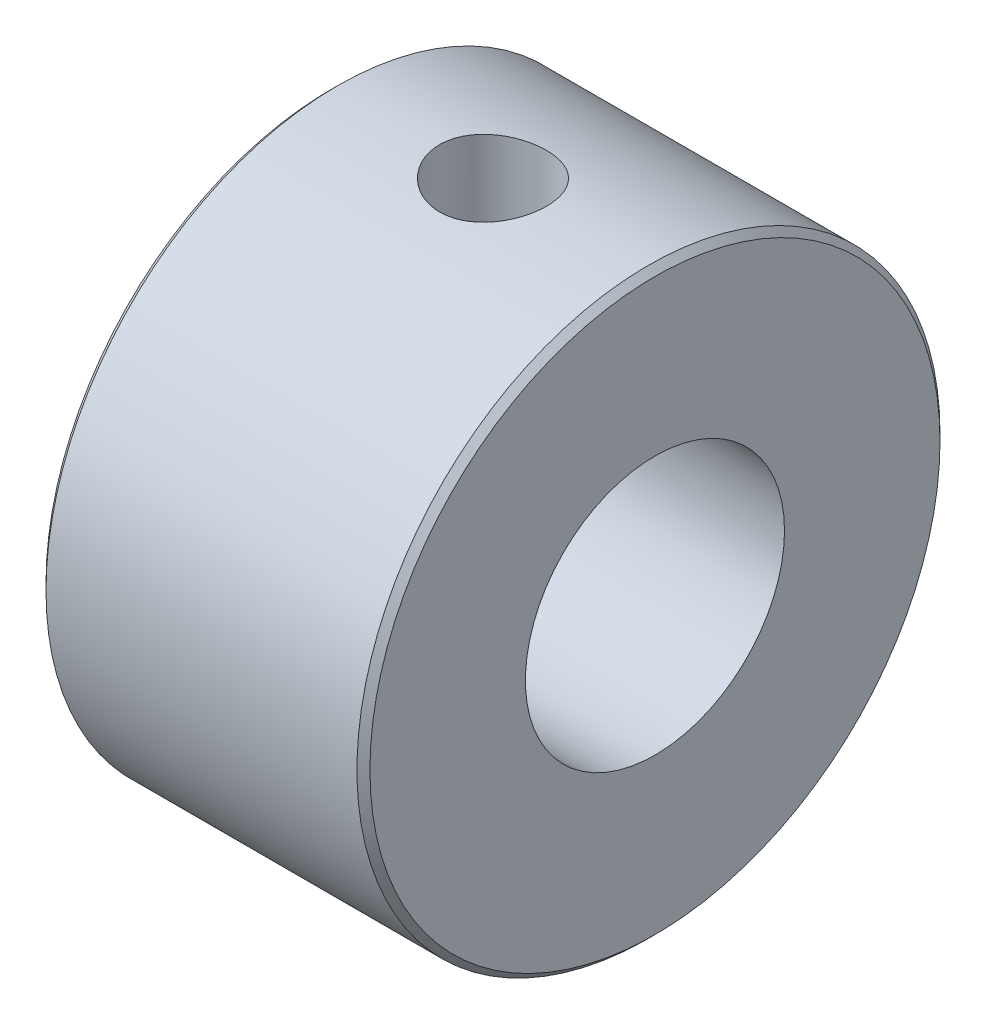
ISO-10303-21;
HEADER;
FILE_DESCRIPTION(('STEP AP214'),'2;1');
FILE_NAME('part.step','',(''),(''),'','','');
FILE_SCHEMA(('AUTOMOTIVE_DESIGN { 1 0 10303 214 1 1 1 1 }'));
ENDSEC;
DATA;
#1=APPLICATION_CONTEXT('core data for automotive mechanical design processes');
#2=APPLICATION_PROTOCOL_DEFINITION('international standard','automotive_design',2000,#1);
#3=PRODUCT_CONTEXT('',#1,'mechanical');
#4=PRODUCT('Part','Part','',(#3));
#5=PRODUCT_RELATED_PRODUCT_CATEGORY('part','',(#4));
#6=PRODUCT_DEFINITION_FORMATION('','',#4);
#7=PRODUCT_DEFINITION_CONTEXT('part definition',#1,'design');
#8=PRODUCT_DEFINITION('design','',#6,#7);
#9=PRODUCT_DEFINITION_SHAPE('','',#8);
#10=(LENGTH_UNIT() NAMED_UNIT(*) SI_UNIT(.MILLI.,.METRE.));
#11=(NAMED_UNIT(*) PLANE_ANGLE_UNIT() SI_UNIT($,.RADIAN.));
#12=(NAMED_UNIT(*) SI_UNIT($,.STERADIAN.) SOLID_ANGLE_UNIT());
#13=UNCERTAINTY_MEASURE_WITH_UNIT(LENGTH_MEASURE(1.E-05),#10,'distance_accuracy_value','');
#14=(GEOMETRIC_REPRESENTATION_CONTEXT(3) GLOBAL_UNCERTAINTY_ASSIGNED_CONTEXT((#13)) GLOBAL_UNIT_ASSIGNED_CONTEXT((#10,
#11,#12)) REPRESENTATION_CONTEXT('',''));
#15=CARTESIAN_POINT('',(0.,0.,0.));
#16=DIRECTION('',(0.,0.,1.));
#17=DIRECTION('',(1.,0.,0.));
#18=AXIS2_PLACEMENT_3D('',#15,#16,#17);
#19=CARTESIAN_POINT('',(-5.,4.,0.));
#20=DIRECTION('',(-1.,0.,0.));
#21=DIRECTION('',(0.,0.,1.));
#22=AXIS2_PLACEMENT_3D('',#19,#20,#21);
#23=PLANE('',#22);
#24=CARTESIAN_POINT('',(-5.,0.,0.));
#25=DIRECTION('',(-1.,0.,0.));
#26=DIRECTION('',(0.,0.,1.));
#27=AXIS2_PLACEMENT_3D('',#24,#25,#26);
#28=CIRCLE('',#27,8.8);
#29=CARTESIAN_POINT('',(-5.,0.,8.8));
#30=VERTEX_POINT('',#29);
#31=EDGE_CURVE('E42',#30,#30,#28,.T.);
#32=ORIENTED_EDGE('',*,*,#31,.T.);
#33=EDGE_LOOP('',(#32));
#34=FACE_BOUND('',#33,.T.);
#35=CARTESIAN_POINT('',(-5.,0.,0.));
#36=DIRECTION('',(1.,0.,0.));
#37=DIRECTION('',(0.,0.,-1.));
#38=AXIS2_PLACEMENT_3D('',#35,#36,#37);
#39=CIRCLE('',#38,4.);
#40=CARTESIAN_POINT('',(-5.,0.,-4.));
#41=VERTEX_POINT('',#40);
#42=EDGE_CURVE('E58',#41,#41,#39,.T.);
#43=ORIENTED_EDGE('',*,*,#42,.T.);
#44=EDGE_LOOP('',(#43));
#45=FACE_BOUND('',#44,.T.);
#46=ADVANCED_FACE('F35',(#34,#45),#23,.T.);
#47=CARTESIAN_POINT('',(0.,0.,0.));
#48=DIRECTION('',(1.,0.,0.));
#49=DIRECTION('',(0.,0.,-1.));
#50=AXIS2_PLACEMENT_3D('',#47,#48,#49);
#51=CYLINDRICAL_SURFACE('',#50,9.);
#52=CARTESIAN_POINT('',(0.,8.84745726183518,1.65));
#53=CARTESIAN_POINT('',(0.091841716806304,8.84745901892198,1.6499964394224));
#54=CARTESIAN_POINT('',(0.183730072862287,8.84890283987554,1.64230590157074));
#55=CARTESIAN_POINT('',(0.36491843627485,8.85451533715862,1.61176613714486));
#56=CARTESIAN_POINT('',(0.454216138401487,8.85868636698503,1.5889038175375));
#57=CARTESIAN_POINT('',(0.627575225681935,8.8692653634472,1.52874392633965));
#58=CARTESIAN_POINT('',(0.711641302568824,8.87567129073683,1.49145951156419));
#59=CARTESIAN_POINT('',(0.872318966166759,8.88999588322384,1.40354823742994));
#60=CARTESIAN_POINT('',(0.948931187193387,8.89791441952948,1.35292251476509));
#61=CARTESIAN_POINT('',(1.09344474662843,8.91447729782653,1.23912329573546));
#62=CARTESIAN_POINT('',(1.16124447842631,8.9231284793793,1.17582174562027));
#63=CARTESIAN_POINT('',(1.28532377113749,8.94012139859551,1.0387445325282));
#64=CARTESIAN_POINT('',(1.34160259156854,8.94846311634063,0.964968196822378));
#65=CARTESIAN_POINT('',(1.44143023942633,8.96397031660691,0.808370094208623));
#66=CARTESIAN_POINT('',(1.48488351836705,8.97112680443415,0.725486450457435));
#67=CARTESIAN_POINT('',(1.55721131952786,8.98338073561932,0.55344239726533));
#68=CARTESIAN_POINT('',(1.58608698763368,8.98847834081121,0.46428248180416));
#69=CARTESIAN_POINT('',(1.62812639623961,8.99599184044781,0.283269124287475));
#70=CARTESIAN_POINT('',(1.64146131577422,8.99843693079941,0.191456669505487));
#71=CARTESIAN_POINT('',(1.65257384170705,9.0004704699038,0.00686726123056629));
#72=CARTESIAN_POINT('',(1.65035271705513,9.00005915166182,-0.0859096129755187));
#73=CARTESIAN_POINT('',(1.63054794927106,8.9964490954066,-0.268621076130759));
#74=CARTESIAN_POINT('',(1.61314860298555,8.99328379793804,-0.358576397674033));
#75=CARTESIAN_POINT('',(1.56377250859941,8.98455889106422,-0.534268634140891));
#76=CARTESIAN_POINT('',(1.53179524669096,8.97899919726735,-0.620005400260819));
#77=CARTESIAN_POINT('',(1.4539938673867,8.96605406715764,-0.785364166009647));
#78=CARTESIAN_POINT('',(1.40809560551311,8.95865889421121,-0.864950487278733));
#79=CARTESIAN_POINT('',(1.30380967341777,8.94286143914684,-1.01536059295368));
#80=CARTESIAN_POINT('',(1.24542078690313,8.93445905898567,-1.0861835229506));
#81=CARTESIAN_POINT('',(1.11679407048166,8.91743323423739,-1.21814777725155));
#82=CARTESIAN_POINT('',(1.04639503298843,8.90880835477524,-1.27913188938372));
#83=CARTESIAN_POINT('',(0.896284673331217,8.89242768228003,-1.38845045398526));
#84=CARTESIAN_POINT('',(0.81657322649666,8.88467190088483,-1.43678473707604));
#85=CARTESIAN_POINT('',(0.649897804808843,8.87090573827501,-1.51947349449105));
#86=CARTESIAN_POINT('',(0.562922661317575,8.86489811106008,-1.55380594446243));
#87=CARTESIAN_POINT('',(0.384303940806849,8.85535127355658,-1.60732704304287));
#88=CARTESIAN_POINT('',(0.292660868894784,8.85181179680057,-1.62651732646586));
#89=CARTESIAN_POINT('',(0.108723051926985,8.84765450127231,-1.64898152750405));
#90=CARTESIAN_POINT('',(0.0164567543449645,8.84699529295656,-1.65248094271885));
#91=CARTESIAN_POINT('',(-0.167342036272254,8.84856252229377,-1.64406780282764));
#92=CARTESIAN_POINT('',(-0.258874563712764,8.85078882384403,-1.63215597463368));
#93=CARTESIAN_POINT('',(-0.437871458620369,8.85783773611537,-1.59345179403482));
#94=CARTESIAN_POINT('',(-0.525362111555018,8.8626398377437,-1.56677693553147));
#95=CARTESIAN_POINT('',(-0.694632030830218,8.87428170227549,-1.49942825863961));
#96=CARTESIAN_POINT('',(-0.776410891952454,8.88112160956848,-1.45875344824718));
#97=CARTESIAN_POINT('',(-0.932931377844609,8.89616305565477,-1.36403772724192));
#98=CARTESIAN_POINT('',(-1.007585148503,8.90437881998151,-1.30985393656712));
#99=CARTESIAN_POINT('',(-1.14682234594555,8.92120592930909,-1.18985171572413));
#100=CARTESIAN_POINT('',(-1.21140490792732,8.92981730819877,-1.1240322874522));
#101=CARTESIAN_POINT('',(-1.32950489724008,8.94659793280905,-0.981621696389441));
#102=CARTESIAN_POINT('',(-1.38287093107066,8.95476015110835,-0.904904026593929));
#103=CARTESIAN_POINT('',(-1.4759562173543,8.96960574193604,-0.743461022632929));
#104=CARTESIAN_POINT('',(-1.51567597873323,8.97628916961134,-0.658735987245476));
#105=CARTESIAN_POINT('',(-1.5801127044637,8.98739384933321,-0.484108123906145));
#106=CARTESIAN_POINT('',(-1.60490503035236,8.9918264466613,-0.394233856891791));
#107=CARTESIAN_POINT('',(-1.63902411901714,8.99797834182,-0.211508393786718));
#108=CARTESIAN_POINT('',(-1.6483524344356,8.99969791204747,-0.118657497514628));
#109=CARTESIAN_POINT('',(-1.65122660159574,9.00022491498226,0.0659317448621679));
#110=CARTESIAN_POINT('',(-1.6450014553555,8.99907460287948,0.1576664835882));
#111=CARTESIAN_POINT('',(-1.61744565731515,8.99407857168315,0.338759580424885));
#112=CARTESIAN_POINT('',(-1.59611513684215,8.99023287602346,0.42811795918876));
#113=CARTESIAN_POINT('',(-1.53904883341866,8.98027777614887,0.601807716590022));
#114=CARTESIAN_POINT('',(-1.50333641133359,8.97417204425898,0.686146994099342));
#115=CARTESIAN_POINT('',(-1.41854706040555,8.9603589790486,0.847670784442995));
#116=CARTESIAN_POINT('',(-1.36946928932208,8.95265154480133,0.92485484596805));
#117=CARTESIAN_POINT('',(-1.25854914798189,8.93635291506659,1.07102106627643));
#118=CARTESIAN_POINT('',(-1.19654084246277,8.92775104266162,1.13987612682785));
#119=CARTESIAN_POINT('',(-1.0618650993429,8.91070173225532,1.26628317842481));
#120=CARTESIAN_POINT('',(-0.989195161937023,8.90225433099627,1.32383251122358));
#121=CARTESIAN_POINT('',(-0.834496379516712,8.88638953245293,1.42646744502769));
#122=CARTESIAN_POINT('',(-0.75239094449208,8.87898183283415,1.47143914338883));
#123=CARTESIAN_POINT('',(-0.581682436673632,8.86615135356349,1.54687963343648));
#124=CARTESIAN_POINT('',(-0.493085666551642,8.86072667839238,1.57736228322634));
#125=CARTESIAN_POINT('',(-0.336840858440317,8.8536227559401,1.61667460639905));
#126=CARTESIAN_POINT('',(-0.270114561918916,8.85132423978349,1.62915050274741));
#127=CARTESIAN_POINT('',(-0.135600634840688,8.84824086306327,1.64581440990914));
#128=CARTESIAN_POINT('',(-0.0678130310010674,8.84745596445762,1.65000262901835));
#129=CARTESIAN_POINT('',(0.,8.84745726183518,1.65));
#130=B_SPLINE_CURVE_WITH_KNOTS('',3,(#52,#53,#54,#55,#56,#57,#58,#59,#60,#61,#62,#63,#64,#65,
#66,#67,#68,#69,#70,#71,#72,#73,#74,#75,#76,#77,#78,#79,#80,#81,#82,#83,#84,#85,#86,#87,#88,#89,
#90,#91,#92,#93,#94,#95,#96,#97,#98,#99,#100,#101,#102,#103,#104,#105,#106,#107,#108,#109,#110,
#111,#112,#113,#114,#115,#116,#117,#118,#119,#120,#121,#122,#123,#124,#125,#126,#127,#128,#129),
.UNSPECIFIED.,.T.,.F.,(4,2,2,2,2,2,2,2,2,2,2,2,2,2,2,2,2,2,2,2,2,2,2,2,2,2,2,2,2,2,2,2,2,2,2,2,
2,2,4),(0.,0.275277027247349,0.550791924145747,0.82605606816602,1.10129676696005,
1.37947266842813,1.65766644345527,1.93788324035369,2.21807800713692,2.49515639448048,
2.77221218003152,3.04595000369877,3.31969747617386,3.59492934730967,3.87018803176225,
4.14948338686983,4.4287824814933,4.70851922412506,4.98822576103179,5.26389940371883,
5.53956004400362,5.81305770418116,6.0865747477553,6.36311747087758,6.63968392732552,
6.9197725663118,7.19985075850151,7.47850284688868,7.75712695590779,8.0316729765667,
8.30621661033371,8.58031608354243,8.85443283360044,9.13231150460447,9.41025543353242,
9.69064042578676,9.97075670045882,10.1740176957908,10.3772735824592),.UNSPECIFIED.);
#131=CARTESIAN_POINT('',(0.,8.84745726183518,1.65));
#132=VERTEX_POINT('',#131);
#133=EDGE_CURVE('E61',#132,#132,#130,.T.);
#134=ORIENTED_EDGE('',*,*,#133,.F.);
#135=EDGE_LOOP('',(#134));
#136=FACE_BOUND('',#135,.T.);
#137=CARTESIAN_POINT('',(-4.8,0.,0.));
#138=DIRECTION('',(-1.,0.,0.));
#139=DIRECTION('',(0.,0.,1.));
#140=AXIS2_PLACEMENT_3D('',#137,#138,#139);
#141=CIRCLE('',#140,9.);
#142=CARTESIAN_POINT('',(-4.8,0.,9.));
#143=VERTEX_POINT('',#142);
#144=EDGE_CURVE('E46',#143,#143,#141,.F.);
#145=ORIENTED_EDGE('',*,*,#144,.T.);
#146=EDGE_LOOP('',(#145));
#147=FACE_BOUND('',#146,.T.);
#148=CARTESIAN_POINT('',(4.8,0.,0.));
#149=DIRECTION('',(1.,0.,0.));
#150=DIRECTION('',(0.,0.,-1.));
#151=AXIS2_PLACEMENT_3D('',#148,#149,#150);
#152=CIRCLE('',#151,9.);
#153=CARTESIAN_POINT('',(4.8,0.,-9.));
#154=VERTEX_POINT('',#153);
#155=EDGE_CURVE('E50',#154,#154,#152,.F.);
#156=ORIENTED_EDGE('',*,*,#155,.T.);
#157=EDGE_LOOP('',(#156));
#158=FACE_BOUND('',#157,.T.);
#159=ADVANCED_FACE('F74',(#136,#147,#158),#51,.T.);
#160=CARTESIAN_POINT('',(5.,4.,0.));
#161=DIRECTION('',(1.,0.,0.));
#162=DIRECTION('',(0.,0.,-1.));
#163=AXIS2_PLACEMENT_3D('',#160,#161,#162);
#164=PLANE('',#163);
#165=CARTESIAN_POINT('',(5.,0.,0.));
#166=DIRECTION('',(1.,0.,0.));
#167=DIRECTION('',(0.,0.,-1.));
#168=AXIS2_PLACEMENT_3D('',#165,#166,#167);
#169=CIRCLE('',#168,8.8);
#170=CARTESIAN_POINT('',(5.,0.,-8.8));
#171=VERTEX_POINT('',#170);
#172=EDGE_CURVE('E10',#171,#171,#169,.T.);
#173=ORIENTED_EDGE('',*,*,#172,.T.);
#174=EDGE_LOOP('',(#173));
#175=FACE_BOUND('',#174,.T.);
#176=CARTESIAN_POINT('',(5.,0.,0.));
#177=DIRECTION('',(1.,0.,0.));
#178=DIRECTION('',(0.,0.,-1.));
#179=AXIS2_PLACEMENT_3D('',#176,#177,#178);
#180=CIRCLE('',#179,4.);
#181=CARTESIAN_POINT('',(5.,0.,-4.));
#182=VERTEX_POINT('',#181);
#183=EDGE_CURVE('E55',#182,#182,#180,.T.);
#184=ORIENTED_EDGE('',*,*,#183,.F.);
#185=EDGE_LOOP('',(#184));
#186=FACE_BOUND('',#185,.T.);
#187=ADVANCED_FACE('F88',(#175,#186),#164,.T.);
#188=CARTESIAN_POINT('',(0.,0.,0.));
#189=DIRECTION('',(1.,0.,0.));
#190=DIRECTION('',(0.,0.,-1.));
#191=AXIS2_PLACEMENT_3D('',#188,#189,#190);
#192=CYLINDRICAL_SURFACE('',#191,4.);
#193=CARTESIAN_POINT('',(0.,3.64383040220041,1.65));
#194=CARTESIAN_POINT('',(-0.0880964802256834,3.64383945275153,1.64999056813102));
#195=CARTESIAN_POINT('',(-0.176340431973593,3.64707173267573,1.64289989177358));
#196=CARTESIAN_POINT('',(-0.350287061078879,3.65959209124688,1.61480845546373));
#197=CARTESIAN_POINT('',(-0.435982100597603,3.66889676295874,1.5937695789634));
#198=CARTESIAN_POINT('',(-0.602002938130633,3.69231325052125,1.53873536249638));
#199=CARTESIAN_POINT('',(-0.682348820218598,3.70640571161012,1.50479212400174));
#200=CARTESIAN_POINT('',(-0.836181766834224,3.73778230052357,1.42506535594206));
#201=CARTESIAN_POINT('',(-0.909670542784035,3.75506562873473,1.37928479159595));
#202=CARTESIAN_POINT('',(-1.0522286878465,3.7920553041855,1.27419856290371));
#203=CARTESIAN_POINT('',(-1.12082925578021,3.81184277704779,1.2142851824136));
#204=CARTESIAN_POINT('',(-1.24735477190876,3.85094363418238,1.08391072165483));
#205=CARTESIAN_POINT('',(-1.30527565147222,3.87025683535296,1.01344563996364));
#206=CARTESIAN_POINT('',(-1.41117137130186,3.90721575035942,0.860301943593382));
#207=CARTESIAN_POINT('',(-1.45862093270616,3.92475616703248,0.77723239011359));
#208=CARTESIAN_POINT('',(-1.5386701453217,3.95520283117798,0.603436361875857));
#209=CARTESIAN_POINT('',(-1.57127626434656,3.96811109652272,0.512713242513044));
#210=CARTESIAN_POINT('',(-1.61902070665623,3.98726403378776,0.331105172304398));
#211=CARTESIAN_POINT('',(-1.63496684792323,3.99381564337609,0.240465625184492));
#212=CARTESIAN_POINT('',(-1.65154665185517,4.0006306156112,0.057576355149865));
#213=CARTESIAN_POINT('',(-1.65218639532201,4.00089647540932,-0.0346727137709553));
#214=CARTESIAN_POINT('',(-1.63856350386341,3.99529224160632,-0.212297380895985));
#215=CARTESIAN_POINT('',(-1.6251878162829,3.98978733384658,-0.297754665400397));
#216=CARTESIAN_POINT('',(-1.58543118255224,3.97375926025944,-0.465085845235279));
#217=CARTESIAN_POINT('',(-1.55904927870932,3.96323572489496,-0.546959476205493));
#218=CARTESIAN_POINT('',(-1.49371233827982,3.93798907731603,-0.70629560681723));
#219=CARTESIAN_POINT('',(-1.45457201007513,3.92320447216362,-0.78367197976247));
#220=CARTESIAN_POINT('',(-1.3650087208134,3.89088763760773,-0.930960489992467));
#221=CARTESIAN_POINT('',(-1.3145817994967,3.87335444442336,-1.00086999453932));
#222=CARTESIAN_POINT('',(-1.19981176097137,3.83587133640027,-1.13638530947041));
#223=CARTESIAN_POINT('',(-1.13474658910128,3.8158381454309,-1.20135746318645));
#224=CARTESIAN_POINT('',(-0.994590333678427,3.77653142784555,-1.31973838423493));
#225=CARTESIAN_POINT('',(-0.9194955507367,3.75725818494773,-1.37314286572202));
#226=CARTESIAN_POINT('',(-0.758401596452686,3.72106607156909,-1.46845339844828));
#227=CARTESIAN_POINT('',(-0.672132428307351,3.70424107982558,-1.50994179309277));
#228=CARTESIAN_POINT('',(-0.492953328594106,3.67596385006485,-1.57754508127096));
#229=CARTESIAN_POINT('',(-0.400048086126186,3.66450786071418,-1.60367071206121));
#230=CARTESIAN_POINT('',(-0.216577104815016,3.64919091711418,-1.63821320355942));
#231=CARTESIAN_POINT('',(-0.126241698817141,3.64489111171831,-1.64765569454682));
#232=CARTESIAN_POINT('',(0.0548056296985968,3.64311980380967,-1.65157101672826));
#233=CARTESIAN_POINT('',(0.145517416059282,3.64564601607449,-1.64604885780402));
#234=CARTESIAN_POINT('',(0.31880100904947,3.65678944366161,-1.62112710501826));
#235=CARTESIAN_POINT('',(0.401528179674606,3.66501803861665,-1.60261202118543));
#236=CARTESIAN_POINT('',(0.56263706437997,3.68614612916707,-1.55339580262015));
#237=CARTESIAN_POINT('',(0.641017771351658,3.69904670212356,-1.52269185697123));
#238=CARTESIAN_POINT('',(0.794879005695636,3.72872477858182,-1.44853902204985));
#239=CARTESIAN_POINT('',(0.870100194779245,3.74564214050945,-1.40460979308264));
#240=CARTESIAN_POINT('',(1.01246016942973,3.78124523189864,-1.30573455409451));
#241=CARTESIAN_POINT('',(1.07959548773512,3.79993171387674,-1.25078384473683));
#242=CARTESIAN_POINT('',(1.20942962644671,3.83876011670653,-1.12627542162099));
#243=CARTESIAN_POINT('',(1.27135173704872,3.85889967217623,-1.05590387126704));
#244=CARTESIAN_POINT('',(1.38264285566206,3.89698114804694,-0.905297980080104));
#245=CARTESIAN_POINT('',(1.4320110520032,3.91492292631236,-0.825063002026905));
#246=CARTESIAN_POINT('',(1.51670413420679,3.94668767391886,-0.656516816883269));
#247=CARTESIAN_POINT('',(1.55200347500273,3.96050313975064,-0.568191273870493));
#248=CARTESIAN_POINT('',(1.60699165685874,3.98237104121021,-0.386140833605178));
#249=CARTESIAN_POINT('',(1.62668958293894,3.9904268305481,-0.292419112817562));
#250=CARTESIAN_POINT('',(1.64878822892048,3.9994889299446,-0.109187189544838));
#251=CARTESIAN_POINT('',(1.65228482874194,4.00094173424749,-0.0198303081186376));
#252=CARTESIAN_POINT('',(1.64481456562972,3.99786220239438,0.158161739195409));
#253=CARTESIAN_POINT('',(1.63385015000455,3.99333087896147,0.246797024648478));
#254=CARTESIAN_POINT('',(1.59855535786444,3.979024148364,0.417705375935874));
#255=CARTESIAN_POINT('',(1.57469555788545,3.96943363922013,0.500092371627849));
#256=CARTESIAN_POINT('',(1.51479588512001,3.94605480923816,0.659667355734158));
#257=CARTESIAN_POINT('',(1.47875367521332,3.93226568297163,0.736854343148742));
#258=CARTESIAN_POINT('',(1.39369547331361,3.90105808483759,0.887661133732617));
#259=CARTESIAN_POINT('',(1.34416874322707,3.88350423911689,0.960964214361148));
#260=CARTESIAN_POINT('',(1.23429715321,3.84685709666619,1.09852932170704));
#261=CARTESIAN_POINT('',(1.17394837691919,3.82776324400832,1.1627880603165));
#262=CARTESIAN_POINT('',(1.03941247264534,3.78859741195738,1.28487769945047));
#263=CARTESIAN_POINT('',(0.964572243115063,3.76854475207571,1.34199767947157));
#264=CARTESIAN_POINT('',(0.805734024318935,3.73105419200534,1.4429647467733));
#265=CARTESIAN_POINT('',(0.721731008290411,3.7136177396712,1.48680449811903));
#266=CARTESIAN_POINT('',(0.547271558730106,3.68370387904713,1.55944447766651));
#267=CARTESIAN_POINT('',(0.456860891908904,3.67119480418034,1.58834112875234));
#268=CARTESIAN_POINT('',(0.271952855921642,3.65281837075147,1.63017263567573));
#269=CARTESIAN_POINT('',(0.177470309123129,3.64692873900432,1.64316103312974));
#270=CARTESIAN_POINT('',(0.0551366863573558,3.64414054419779,1.6493120932942));
#271=CARTESIAN_POINT('',(0.0275755677149824,3.64382756923723,1.6500029523216));
#272=CARTESIAN_POINT('',(0.,3.64383040220041,1.65));
#273=B_SPLINE_CURVE_WITH_KNOTS('',3,(#193,#194,#195,#196,#197,#198,#199,#200,#201,#202,#203,
#204,#205,#206,#207,#208,#209,#210,#211,#212,#213,#214,#215,#216,#217,#218,#219,#220,#221,#222,
#223,#224,#225,#226,#227,#228,#229,#230,#231,#232,#233,#234,#235,#236,#237,#238,#239,#240,#241,
#242,#243,#244,#245,#246,#247,#248,#249,#250,#251,#252,#253,#254,#255,#256,#257,#258,#259,#260,
#261,#262,#263,#264,#265,#266,#267,#268,#269,#270,#271,#272),.UNSPECIFIED.,.T.,.F.,(4,2,2,2,2,2,
2,2,2,2,2,2,2,2,2,2,2,2,2,2,2,2,2,2,2,2,2,2,2,2,2,2,2,2,2,2,2,2,2,4),(0.,0.264211724660744,
0.529148459018597,0.793026677872048,1.05683885985756,1.33523297260792,1.61373292676209,
1.90403076094908,2.19420198072699,2.4695381624427,2.74476495901023,3.00356896819765,
3.26239203686791,3.5251552692474,3.78801084539545,4.06907613148064,4.35024537535724,
4.64031806272423,4.9301877724111,5.20152035698263,5.47276211576042,5.72713321026165,
5.9815630002888,6.24665916965708,6.51186861189123,6.79815687284346,7.08446363898863,
7.3712879145617,7.6579450434915,7.92489841526079,8.19180661499934,8.44957452423759,
8.70739191275387,8.97680852354694,9.24632283025306,9.53374725602174,9.82133016535515,
10.1070334851925,10.3917725616094,10.4744749384332),.UNSPECIFIED.);
#274=CARTESIAN_POINT('',(0.,3.64383040220041,1.65));
#275=VERTEX_POINT('',#274);
#276=EDGE_CURVE('E69',#275,#275,#273,.T.);
#277=ORIENTED_EDGE('',*,*,#276,.F.);
#278=EDGE_LOOP('',(#277));
#279=FACE_BOUND('',#278,.T.);
#280=ORIENTED_EDGE('',*,*,#183,.T.);
#281=EDGE_LOOP('',(#280));
#282=FACE_BOUND('',#281,.T.);
#283=ORIENTED_EDGE('',*,*,#42,.F.);
#284=EDGE_LOOP('',(#283));
#285=FACE_BOUND('',#284,.T.);
#286=ADVANCED_FACE('F85',(#279,#282,#285),#192,.F.);
#287=CARTESIAN_POINT('',(-4.8,0.,0.));
#288=DIRECTION('',(1.,0.,0.));
#289=DIRECTION('',(0.,0.,-1.));
#290=AXIS2_PLACEMENT_3D('',#287,#288,#289);
#291=CONICAL_SURFACE('',#290,9.,0.785398163397453);
#292=ORIENTED_EDGE('',*,*,#31,.F.);
#293=EDGE_LOOP('',(#292));
#294=FACE_BOUND('',#293,.T.);
#295=ORIENTED_EDGE('',*,*,#144,.F.);
#296=EDGE_LOOP('',(#295));
#297=FACE_BOUND('',#296,.T.);
#298=ADVANCED_FACE('F87',(#294,#297),#291,.T.);
#299=CARTESIAN_POINT('',(5.,0.,0.));
#300=DIRECTION('',(-1.,0.,0.));
#301=DIRECTION('',(0.,0.,1.));
#302=AXIS2_PLACEMENT_3D('',#299,#300,#301);
#303=CONICAL_SURFACE('',#302,8.8,0.785398163397448);
#304=ORIENTED_EDGE('',*,*,#155,.F.);
#305=EDGE_LOOP('',(#304));
#306=FACE_BOUND('',#305,.T.);
#307=ORIENTED_EDGE('',*,*,#172,.F.);
#308=EDGE_LOOP('',(#307));
#309=FACE_BOUND('',#308,.T.);
#310=ADVANCED_FACE('F37',(#306,#309),#303,.T.);
#311=CARTESIAN_POINT('',(0.,9.,0.));
#312=DIRECTION('',(0.,1.,0.));
#313=DIRECTION('',(0.,0.,1.));
#314=AXIS2_PLACEMENT_3D('',#311,#312,#313);
#315=CYLINDRICAL_SURFACE('',#314,1.65);
#316=ORIENTED_EDGE('',*,*,#133,.T.);
#317=EDGE_LOOP('',(#316));
#318=FACE_BOUND('',#317,.T.);
#319=ORIENTED_EDGE('',*,*,#276,.T.);
#320=EDGE_LOOP('',(#319));
#321=FACE_BOUND('',#320,.T.);
#322=ADVANCED_FACE('F78',(#318,#321),#315,.F.);
#323=CLOSED_SHELL('',(#46,#159,#187,#286,#298,#310,#322));
#324=MANIFOLD_SOLID_BREP('B2',#323);
#325=ADVANCED_BREP_SHAPE_REPRESENTATION('',(#18,#324),#14);
#326=SHAPE_DEFINITION_REPRESENTATION(#9,#325);
ENDSEC;
END-ISO-10303-21;
